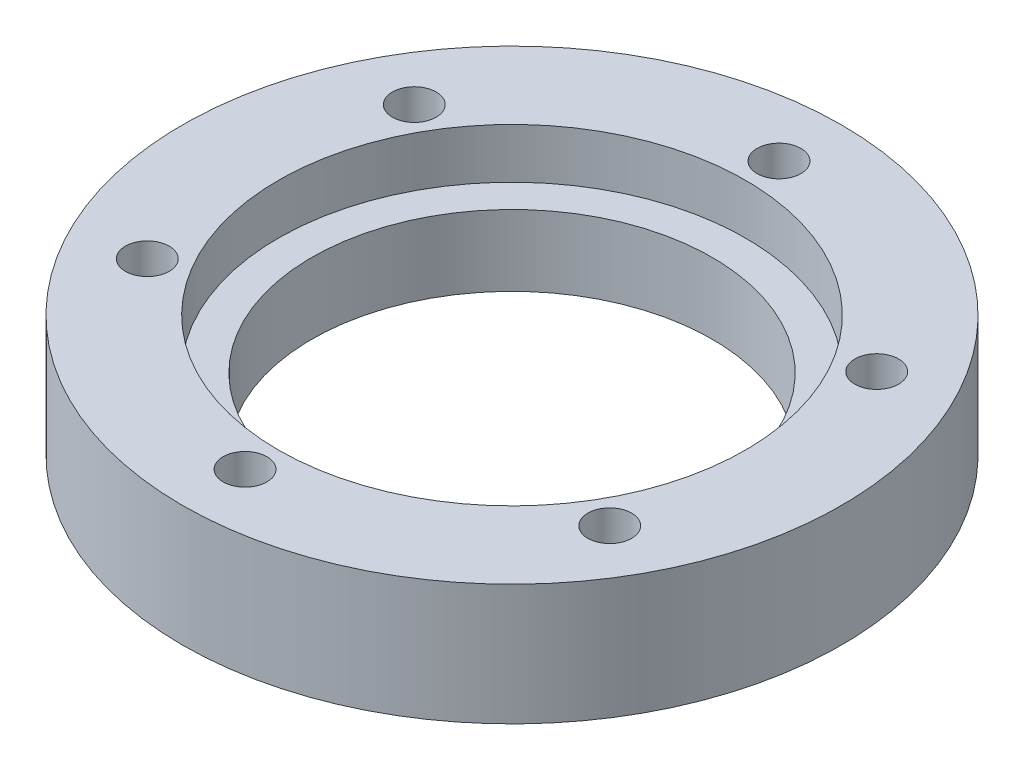
ISO-10303-21;
HEADER;
FILE_DESCRIPTION(('STEP AP214'),'2;1');
FILE_NAME('part.step','',(''),(''),'','','');
FILE_SCHEMA(('AUTOMOTIVE_DESIGN { 1 0 10303 214 1 1 1 1 }'));
ENDSEC;
DATA;
#1=APPLICATION_CONTEXT('core data for automotive mechanical design processes');
#2=APPLICATION_PROTOCOL_DEFINITION('international standard','automotive_design',2000,#1);
#3=PRODUCT_CONTEXT('',#1,'mechanical');
#4=PRODUCT('Part','Part','',(#3));
#5=PRODUCT_RELATED_PRODUCT_CATEGORY('part','',(#4));
#6=PRODUCT_DEFINITION_FORMATION('','',#4);
#7=PRODUCT_DEFINITION_CONTEXT('part definition',#1,'design');
#8=PRODUCT_DEFINITION('design','',#6,#7);
#9=PRODUCT_DEFINITION_SHAPE('','',#8);
#10=(LENGTH_UNIT() NAMED_UNIT(*) SI_UNIT(.MILLI.,.METRE.));
#11=(NAMED_UNIT(*) PLANE_ANGLE_UNIT() SI_UNIT($,.RADIAN.));
#12=(NAMED_UNIT(*) SI_UNIT($,.STERADIAN.) SOLID_ANGLE_UNIT());
#13=UNCERTAINTY_MEASURE_WITH_UNIT(LENGTH_MEASURE(1.E-05),#10,'distance_accuracy_value','');
#14=(GEOMETRIC_REPRESENTATION_CONTEXT(3) GLOBAL_UNCERTAINTY_ASSIGNED_CONTEXT((#13)) GLOBAL_UNIT_ASSIGNED_CONTEXT((#10,
#11,#12)) REPRESENTATION_CONTEXT('',''));
#15=CARTESIAN_POINT('',(0.,0.,0.));
#16=DIRECTION('',(0.,0.,1.));
#17=DIRECTION('',(1.,0.,0.));
#18=AXIS2_PLACEMENT_3D('',#15,#16,#17);
#19=CARTESIAN_POINT('',(0.,29.,0.));
#20=DIRECTION('',(0.,-1.,0.));
#21=DIRECTION('',(0.,0.,-1.));
#22=AXIS2_PLACEMENT_3D('',#19,#20,#21);
#23=CYLINDRICAL_SURFACE('',#22,79.);
#24=CARTESIAN_POINT('',(0.,29.,0.));
#25=DIRECTION('',(0.,1.,0.));
#26=DIRECTION('',(0.,0.,1.));
#27=AXIS2_PLACEMENT_3D('',#24,#25,#26);
#28=CIRCLE('',#27,79.);
#29=CARTESIAN_POINT('',(0.,29.,79.));
#30=VERTEX_POINT('',#29);
#31=EDGE_CURVE('E10',#30,#30,#28,.T.);
#32=ORIENTED_EDGE('',*,*,#31,.F.);
#33=EDGE_LOOP('',(#32));
#34=FACE_BOUND('',#33,.T.);
#35=CARTESIAN_POINT('',(0.,0.,0.));
#36=DIRECTION('',(0.,1.,0.));
#37=DIRECTION('',(0.,0.,1.));
#38=AXIS2_PLACEMENT_3D('',#35,#36,#37);
#39=CIRCLE('',#38,79.);
#40=CARTESIAN_POINT('',(0.,0.,79.));
#41=VERTEX_POINT('',#40);
#42=EDGE_CURVE('E40',#41,#41,#39,.T.);
#43=ORIENTED_EDGE('',*,*,#42,.T.);
#44=EDGE_LOOP('',(#43));
#45=FACE_BOUND('',#44,.T.);
#46=ADVANCED_FACE('F37',(#34,#45),#23,.T.);
#47=CARTESIAN_POINT('',(0.,29.,0.));
#48=DIRECTION('',(0.,1.,0.));
#49=DIRECTION('',(0.,0.,1.));
#50=AXIS2_PLACEMENT_3D('',#47,#48,#49);
#51=PLANE('',#50);
#52=CARTESIAN_POINT('',(55.4256258422041,29.,32.));
#53=DIRECTION('',(0.,1.,0.));
#54=DIRECTION('',(0.,0.,1.));
#55=AXIS2_PLACEMENT_3D('',#52,#53,#54);
#56=CIRCLE('',#55,5.25);
#57=CARTESIAN_POINT('',(55.4256258422041,29.,37.25));
#58=VERTEX_POINT('',#57);
#59=EDGE_CURVE('E110',#58,#58,#56,.T.);
#60=ORIENTED_EDGE('',*,*,#59,.F.);
#61=EDGE_LOOP('',(#60));
#62=FACE_BOUND('',#61,.T.);
#63=CARTESIAN_POINT('',(-1.52655665885959E-13,29.,64.));
#64=DIRECTION('',(0.,1.,0.));
#65=DIRECTION('',(0.,0.,1.));
#66=AXIS2_PLACEMENT_3D('',#63,#64,#65);
#67=CIRCLE('',#66,5.25);
#68=CARTESIAN_POINT('',(-1.52655665885959E-13,29.,69.25));
#69=VERTEX_POINT('',#68);
#70=EDGE_CURVE('E102',#69,#69,#67,.T.);
#71=ORIENTED_EDGE('',*,*,#70,.F.);
#72=EDGE_LOOP('',(#71));
#73=FACE_BOUND('',#72,.T.);
#74=CARTESIAN_POINT('',(-55.4256258422042,29.,31.9999999999997));
#75=DIRECTION('',(0.,1.,0.));
#76=DIRECTION('',(0.,0.,1.));
#77=AXIS2_PLACEMENT_3D('',#74,#75,#76);
#78=CIRCLE('',#77,5.25);
#79=CARTESIAN_POINT('',(-55.4256258422042,29.,37.2499999999997));
#80=VERTEX_POINT('',#79);
#81=EDGE_CURVE('E94',#80,#80,#78,.T.);
#82=ORIENTED_EDGE('',*,*,#81,.F.);
#83=EDGE_LOOP('',(#82));
#84=FACE_BOUND('',#83,.T.);
#85=CARTESIAN_POINT('',(-55.4256258422038,29.,-32.0000000000004));
#86=DIRECTION('',(0.,1.,0.));
#87=DIRECTION('',(0.,0.,1.));
#88=AXIS2_PLACEMENT_3D('',#85,#86,#87);
#89=CIRCLE('',#88,5.25);
#90=CARTESIAN_POINT('',(-55.4256258422038,29.,-26.7500000000004));
#91=VERTEX_POINT('',#90);
#92=EDGE_CURVE('E86',#91,#91,#89,.T.);
#93=ORIENTED_EDGE('',*,*,#92,.F.);
#94=EDGE_LOOP('',(#93));
#95=FACE_BOUND('',#94,.T.);
#96=CARTESIAN_POINT('',(5.96744875736022E-13,29.,-64.));
#97=DIRECTION('',(0.,1.,0.));
#98=DIRECTION('',(0.,0.,1.));
#99=AXIS2_PLACEMENT_3D('',#96,#97,#98);
#100=CIRCLE('',#99,5.25);
#101=CARTESIAN_POINT('',(5.96744875736022E-13,29.,-58.75));
#102=VERTEX_POINT('',#101);
#103=EDGE_CURVE('E78',#102,#102,#100,.T.);
#104=ORIENTED_EDGE('',*,*,#103,.F.);
#105=EDGE_LOOP('',(#104));
#106=FACE_BOUND('',#105,.T.);
#107=CARTESIAN_POINT('',(55.4256258422044,29.,-31.9999999999993));
#108=DIRECTION('',(0.,1.,0.));
#109=DIRECTION('',(0.,0.,1.));
#110=AXIS2_PLACEMENT_3D('',#107,#108,#109);
#111=CIRCLE('',#110,5.25);
#112=CARTESIAN_POINT('',(55.4256258422044,29.,-26.7499999999993));
#113=VERTEX_POINT('',#112);
#114=EDGE_CURVE('E70',#113,#113,#111,.T.);
#115=ORIENTED_EDGE('',*,*,#114,.F.);
#116=EDGE_LOOP('',(#115));
#117=FACE_BOUND('',#116,.T.);
#118=CARTESIAN_POINT('',(0.,29.,0.));
#119=DIRECTION('',(0.,1.,0.));
#120=DIRECTION('',(0.,0.,1.));
#121=AXIS2_PLACEMENT_3D('',#118,#119,#120);
#122=CIRCLE('',#121,56.);
#123=CARTESIAN_POINT('',(0.,29.,56.));
#124=VERTEX_POINT('',#123);
#125=EDGE_CURVE('E62',#124,#124,#122,.T.);
#126=ORIENTED_EDGE('',*,*,#125,.F.);
#127=EDGE_LOOP('',(#126));
#128=FACE_BOUND('',#127,.T.);
#129=ORIENTED_EDGE('',*,*,#31,.T.);
#130=EDGE_LOOP('',(#129));
#131=FACE_BOUND('',#130,.T.);
#132=ADVANCED_FACE('F117',(#62,#73,#84,#95,#106,#117,#128,#131),#51,.T.);
#133=CARTESIAN_POINT('',(0.,0.,0.));
#134=DIRECTION('',(0.,1.,0.));
#135=DIRECTION('',(0.,0.,1.));
#136=AXIS2_PLACEMENT_3D('',#133,#134,#135);
#137=PLANE('',#136);
#138=CARTESIAN_POINT('',(55.4256258422041,0.,32.));
#139=DIRECTION('',(0.,1.,0.));
#140=DIRECTION('',(0.,0.,1.));
#141=AXIS2_PLACEMENT_3D('',#138,#139,#140);
#142=CIRCLE('',#141,5.25);
#143=CARTESIAN_POINT('',(55.4256258422041,0.,37.25));
#144=VERTEX_POINT('',#143);
#145=EDGE_CURVE('E106',#144,#144,#142,.T.);
#146=ORIENTED_EDGE('',*,*,#145,.T.);
#147=EDGE_LOOP('',(#146));
#148=FACE_BOUND('',#147,.T.);
#149=CARTESIAN_POINT('',(-1.52655665885959E-13,0.,64.));
#150=DIRECTION('',(0.,1.,0.));
#151=DIRECTION('',(0.,0.,1.));
#152=AXIS2_PLACEMENT_3D('',#149,#150,#151);
#153=CIRCLE('',#152,5.25);
#154=CARTESIAN_POINT('',(-1.52655665885959E-13,0.,69.25));
#155=VERTEX_POINT('',#154);
#156=EDGE_CURVE('E98',#155,#155,#153,.T.);
#157=ORIENTED_EDGE('',*,*,#156,.T.);
#158=EDGE_LOOP('',(#157));
#159=FACE_BOUND('',#158,.T.);
#160=CARTESIAN_POINT('',(-55.4256258422042,0.,31.9999999999997));
#161=DIRECTION('',(0.,1.,0.));
#162=DIRECTION('',(0.,0.,1.));
#163=AXIS2_PLACEMENT_3D('',#160,#161,#162);
#164=CIRCLE('',#163,5.25);
#165=CARTESIAN_POINT('',(-55.4256258422042,0.,37.2499999999997));
#166=VERTEX_POINT('',#165);
#167=EDGE_CURVE('E90',#166,#166,#164,.T.);
#168=ORIENTED_EDGE('',*,*,#167,.T.);
#169=EDGE_LOOP('',(#168));
#170=FACE_BOUND('',#169,.T.);
#171=CARTESIAN_POINT('',(-55.4256258422038,0.,-32.0000000000004));
#172=DIRECTION('',(0.,1.,0.));
#173=DIRECTION('',(0.,0.,1.));
#174=AXIS2_PLACEMENT_3D('',#171,#172,#173);
#175=CIRCLE('',#174,5.25);
#176=CARTESIAN_POINT('',(-55.4256258422038,0.,-26.7500000000004));
#177=VERTEX_POINT('',#176);
#178=EDGE_CURVE('E82',#177,#177,#175,.T.);
#179=ORIENTED_EDGE('',*,*,#178,.T.);
#180=EDGE_LOOP('',(#179));
#181=FACE_BOUND('',#180,.T.);
#182=CARTESIAN_POINT('',(5.96744875736022E-13,0.,-64.));
#183=DIRECTION('',(0.,1.,0.));
#184=DIRECTION('',(0.,0.,1.));
#185=AXIS2_PLACEMENT_3D('',#182,#183,#184);
#186=CIRCLE('',#185,5.25);
#187=CARTESIAN_POINT('',(5.96744875736022E-13,0.,-58.75));
#188=VERTEX_POINT('',#187);
#189=EDGE_CURVE('E74',#188,#188,#186,.T.);
#190=ORIENTED_EDGE('',*,*,#189,.T.);
#191=EDGE_LOOP('',(#190));
#192=FACE_BOUND('',#191,.T.);
#193=CARTESIAN_POINT('',(55.4256258422044,0.,-31.9999999999993));
#194=DIRECTION('',(0.,1.,0.));
#195=DIRECTION('',(0.,0.,1.));
#196=AXIS2_PLACEMENT_3D('',#193,#194,#195);
#197=CIRCLE('',#196,5.25);
#198=CARTESIAN_POINT('',(55.4256258422044,0.,-26.7499999999993));
#199=VERTEX_POINT('',#198);
#200=EDGE_CURVE('E66',#199,#199,#197,.T.);
#201=ORIENTED_EDGE('',*,*,#200,.T.);
#202=EDGE_LOOP('',(#201));
#203=FACE_BOUND('',#202,.T.);
#204=CARTESIAN_POINT('',(0.,0.,0.));
#205=DIRECTION('',(0.,1.,0.));
#206=DIRECTION('',(0.,0.,1.));
#207=AXIS2_PLACEMENT_3D('',#204,#205,#206);
#208=CIRCLE('',#207,48.);
#209=CARTESIAN_POINT('',(0.,0.,48.));
#210=VERTEX_POINT('',#209);
#211=EDGE_CURVE('E49',#210,#210,#208,.T.);
#212=ORIENTED_EDGE('',*,*,#211,.T.);
#213=EDGE_LOOP('',(#212));
#214=FACE_BOUND('',#213,.T.);
#215=ORIENTED_EDGE('',*,*,#42,.F.);
#216=EDGE_LOOP('',(#215));
#217=FACE_BOUND('',#216,.T.);
#218=ADVANCED_FACE('F120',(#148,#159,#170,#181,#192,#203,#214,#217),#137,.F.);
#219=CARTESIAN_POINT('',(0.,29.,0.));
#220=DIRECTION('',(0.,1.,0.));
#221=DIRECTION('',(0.,0.,1.));
#222=AXIS2_PLACEMENT_3D('',#219,#220,#221);
#223=CYLINDRICAL_SURFACE('',#222,48.);
#224=ORIENTED_EDGE('',*,*,#211,.F.);
#225=EDGE_LOOP('',(#224));
#226=FACE_BOUND('',#225,.T.);
#227=CARTESIAN_POINT('',(0.,17.,0.));
#228=DIRECTION('',(0.,1.,0.));
#229=DIRECTION('',(0.,0.,1.));
#230=AXIS2_PLACEMENT_3D('',#227,#228,#229);
#231=CIRCLE('',#230,48.);
#232=CARTESIAN_POINT('',(0.,17.,48.));
#233=VERTEX_POINT('',#232);
#234=EDGE_CURVE('E54',#233,#233,#231,.T.);
#235=ORIENTED_EDGE('',*,*,#234,.T.);
#236=EDGE_LOOP('',(#235));
#237=FACE_BOUND('',#236,.T.);
#238=ADVANCED_FACE('F147',(#226,#237),#223,.F.);
#239=CARTESIAN_POINT('',(48.,17.,0.));
#240=DIRECTION('',(0.,-1.,0.));
#241=DIRECTION('',(0.,0.,-1.));
#242=AXIS2_PLACEMENT_3D('',#239,#240,#241);
#243=PLANE('',#242);
#244=ORIENTED_EDGE('',*,*,#234,.F.);
#245=EDGE_LOOP('',(#244));
#246=FACE_BOUND('',#245,.T.);
#247=CARTESIAN_POINT('',(0.,17.,0.));
#248=DIRECTION('',(0.,1.,0.));
#249=DIRECTION('',(0.,0.,1.));
#250=AXIS2_PLACEMENT_3D('',#247,#248,#249);
#251=CIRCLE('',#250,56.);
#252=CARTESIAN_POINT('',(0.,17.,56.));
#253=VERTEX_POINT('',#252);
#254=EDGE_CURVE('E58',#253,#253,#251,.T.);
#255=ORIENTED_EDGE('',*,*,#254,.T.);
#256=EDGE_LOOP('',(#255));
#257=FACE_BOUND('',#256,.T.);
#258=ADVANCED_FACE('F137',(#246,#257),#243,.F.);
#259=CARTESIAN_POINT('',(0.,29.,0.));
#260=DIRECTION('',(0.,1.,0.));
#261=DIRECTION('',(0.,0.,1.));
#262=AXIS2_PLACEMENT_3D('',#259,#260,#261);
#263=CYLINDRICAL_SURFACE('',#262,56.);
#264=ORIENTED_EDGE('',*,*,#254,.F.);
#265=EDGE_LOOP('',(#264));
#266=FACE_BOUND('',#265,.T.);
#267=ORIENTED_EDGE('',*,*,#125,.T.);
#268=EDGE_LOOP('',(#267));
#269=FACE_BOUND('',#268,.T.);
#270=ADVANCED_FACE('F134',(#266,#269),#263,.F.);
#271=CARTESIAN_POINT('',(55.4256258422044,29.,-31.9999999999993));
#272=DIRECTION('',(0.,1.,0.));
#273=DIRECTION('',(0.,0.,1.));
#274=AXIS2_PLACEMENT_3D('',#271,#272,#273);
#275=CYLINDRICAL_SURFACE('',#274,5.25);
#276=ORIENTED_EDGE('',*,*,#200,.F.);
#277=EDGE_LOOP('',(#276));
#278=FACE_BOUND('',#277,.T.);
#279=ORIENTED_EDGE('',*,*,#114,.T.);
#280=EDGE_LOOP('',(#279));
#281=FACE_BOUND('',#280,.T.);
#282=ADVANCED_FACE('F136',(#278,#281),#275,.F.);
#283=CARTESIAN_POINT('',(5.96744875736022E-13,29.,-64.));
#284=DIRECTION('',(0.,1.,0.));
#285=DIRECTION('',(0.,0.,1.));
#286=AXIS2_PLACEMENT_3D('',#283,#284,#285);
#287=CYLINDRICAL_SURFACE('',#286,5.25);
#288=ORIENTED_EDGE('',*,*,#189,.F.);
#289=EDGE_LOOP('',(#288));
#290=FACE_BOUND('',#289,.T.);
#291=ORIENTED_EDGE('',*,*,#103,.T.);
#292=EDGE_LOOP('',(#291));
#293=FACE_BOUND('',#292,.T.);
#294=ADVANCED_FACE('F144',(#290,#293),#287,.F.);
#295=CARTESIAN_POINT('',(-55.4256258422038,29.,-32.0000000000004));
#296=DIRECTION('',(0.,1.,0.));
#297=DIRECTION('',(0.,0.,1.));
#298=AXIS2_PLACEMENT_3D('',#295,#296,#297);
#299=CYLINDRICAL_SURFACE('',#298,5.25);
#300=ORIENTED_EDGE('',*,*,#178,.F.);
#301=EDGE_LOOP('',(#300));
#302=FACE_BOUND('',#301,.T.);
#303=ORIENTED_EDGE('',*,*,#92,.T.);
#304=EDGE_LOOP('',(#303));
#305=FACE_BOUND('',#304,.T.);
#306=ADVANCED_FACE('F185',(#302,#305),#299,.F.);
#307=CARTESIAN_POINT('',(-55.4256258422042,29.,31.9999999999997));
#308=DIRECTION('',(0.,1.,0.));
#309=DIRECTION('',(0.,0.,1.));
#310=AXIS2_PLACEMENT_3D('',#307,#308,#309);
#311=CYLINDRICAL_SURFACE('',#310,5.25);
#312=ORIENTED_EDGE('',*,*,#167,.F.);
#313=EDGE_LOOP('',(#312));
#314=FACE_BOUND('',#313,.T.);
#315=ORIENTED_EDGE('',*,*,#81,.T.);
#316=EDGE_LOOP('',(#315));
#317=FACE_BOUND('',#316,.T.);
#318=ADVANCED_FACE('F190',(#314,#317),#311,.F.);
#319=CARTESIAN_POINT('',(-1.52655665885959E-13,29.,64.));
#320=DIRECTION('',(0.,1.,0.));
#321=DIRECTION('',(0.,0.,1.));
#322=AXIS2_PLACEMENT_3D('',#319,#320,#321);
#323=CYLINDRICAL_SURFACE('',#322,5.25);
#324=ORIENTED_EDGE('',*,*,#156,.F.);
#325=EDGE_LOOP('',(#324));
#326=FACE_BOUND('',#325,.T.);
#327=ORIENTED_EDGE('',*,*,#70,.T.);
#328=EDGE_LOOP('',(#327));
#329=FACE_BOUND('',#328,.T.);
#330=ADVANCED_FACE('F196',(#326,#329),#323,.F.);
#331=CARTESIAN_POINT('',(55.4256258422041,29.,32.));
#332=DIRECTION('',(0.,1.,0.));
#333=DIRECTION('',(0.,0.,1.));
#334=AXIS2_PLACEMENT_3D('',#331,#332,#333);
#335=CYLINDRICAL_SURFACE('',#334,5.25);
#336=ORIENTED_EDGE('',*,*,#145,.F.);
#337=EDGE_LOOP('',(#336));
#338=FACE_BOUND('',#337,.T.);
#339=ORIENTED_EDGE('',*,*,#59,.T.);
#340=EDGE_LOOP('',(#339));
#341=FACE_BOUND('',#340,.T.);
#342=ADVANCED_FACE('F115',(#338,#341),#335,.F.);
#343=CLOSED_SHELL('',(#46,#132,#218,#238,#258,#270,#282,#294,#306,#318,#330,#342));
#344=MANIFOLD_SOLID_BREP('B2',#343);
#345=ADVANCED_BREP_SHAPE_REPRESENTATION('',(#18,#344),#14);
#346=SHAPE_DEFINITION_REPRESENTATION(#9,#345);
ENDSEC;
END-ISO-10303-21;
